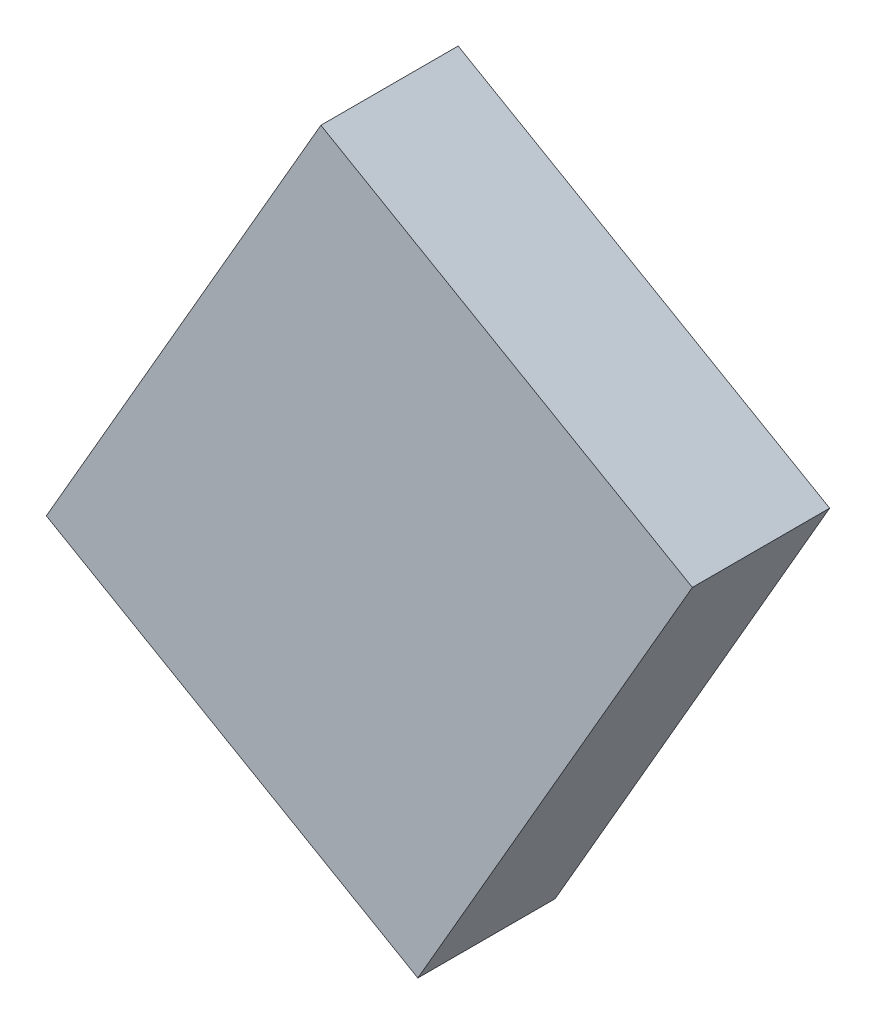
ISO-10303-21;
HEADER;
FILE_DESCRIPTION(('STEP AP214'),'2;1');
FILE_NAME('part.step','',(''),(''),'','','');
FILE_SCHEMA(('AUTOMOTIVE_DESIGN { 1 0 10303 214 1 1 1 1 }'));
ENDSEC;
DATA;
#1=APPLICATION_CONTEXT('core data for automotive mechanical design processes');
#2=APPLICATION_PROTOCOL_DEFINITION('international standard','automotive_design',2000,#1);
#3=PRODUCT_CONTEXT('',#1,'mechanical');
#4=PRODUCT('Part','Part','',(#3));
#5=PRODUCT_RELATED_PRODUCT_CATEGORY('part','',(#4));
#6=PRODUCT_DEFINITION_FORMATION('','',#4);
#7=PRODUCT_DEFINITION_CONTEXT('part definition',#1,'design');
#8=PRODUCT_DEFINITION('design','',#6,#7);
#9=PRODUCT_DEFINITION_SHAPE('','',#8);
#10=(LENGTH_UNIT() NAMED_UNIT(*) SI_UNIT(.MILLI.,.METRE.));
#11=(NAMED_UNIT(*) PLANE_ANGLE_UNIT() SI_UNIT($,.RADIAN.));
#12=(NAMED_UNIT(*) SI_UNIT($,.STERADIAN.) SOLID_ANGLE_UNIT());
#13=UNCERTAINTY_MEASURE_WITH_UNIT(LENGTH_MEASURE(1.E-05),#10,'distance_accuracy_value','');
#14=(GEOMETRIC_REPRESENTATION_CONTEXT(3) GLOBAL_UNCERTAINTY_ASSIGNED_CONTEXT((#13)) GLOBAL_UNIT_ASSIGNED_CONTEXT((#10,
#11,#12)) REPRESENTATION_CONTEXT('',''));
#15=CARTESIAN_POINT('',(0.,0.,0.));
#16=DIRECTION('',(0.,0.,1.));
#17=DIRECTION('',(1.,0.,0.));
#18=AXIS2_PLACEMENT_3D('',#15,#16,#17);
#19=CARTESIAN_POINT('',(0.28253436,-2.0106386,0.80000094));
#20=DIRECTION('',(0.,0.,-1.));
#21=DIRECTION('',(-1.,0.,0.));
#22=AXIS2_PLACEMENT_3D('',#19,#20,#21);
#23=PLANE('',#22);
#24=DIRECTION('',(0.86602559790979,-0.499999663764879,0.));
#25=VECTOR('',#24,1.);
#26=CARTESIAN_POINT('',(1.8825337,0.7606411,0.80000094));
#27=LINE('',#26,#25);
#28=CARTESIAN_POINT('',(1.88253369999973,0.760641100000156,0.80000094));
#29=VERTEX_POINT('',#28);
#30=CARTESIAN_POINT('',(-0.282531819999916,2.01064114000015,0.80000094));
#31=VERTEX_POINT('',#30);
#32=EDGE_CURVE('E55',#29,#31,#27,.F.);
#33=ORIENTED_EDGE('',*,*,#32,.T.);
#34=DIRECTION('',(0.500000060750926,0.866025368709872,0.));
#35=VECTOR('',#34,1.);
#36=CARTESIAN_POINT('',(-0.28253182,2.01064114,0.80000094));
#37=LINE('',#36,#35);
#38=CARTESIAN_POINT('',(-1.88253115999973,-0.760638560000156,0.80000094));
#39=VERTEX_POINT('',#38);
#40=EDGE_CURVE('E57',#31,#39,#37,.F.);
#41=ORIENTED_EDGE('',*,*,#40,.T.);
#42=DIRECTION('',(-0.86602559790979,0.499999663764879,0.));
#43=VECTOR('',#42,1.);
#44=CARTESIAN_POINT('',(-1.88253116,-0.76063856,0.80000094));
#45=LINE('',#44,#43);
#46=CARTESIAN_POINT('',(0.282534359999832,-2.01063860000029,0.80000094));
#47=VERTEX_POINT('',#46);
#48=EDGE_CURVE('E20',#39,#47,#45,.F.);
#49=ORIENTED_EDGE('',*,*,#48,.T.);
#50=DIRECTION('',(-0.500000060750926,-0.866025368709872,0.));
#51=VECTOR('',#50,1.);
#52=CARTESIAN_POINT('',(0.28253436,-2.0106386,0.80000094));
#53=LINE('',#52,#51);
#54=EDGE_CURVE('E80',#47,#29,#53,.F.);
#55=ORIENTED_EDGE('',*,*,#54,.T.);
#56=EDGE_LOOP('',(#33,#41,#49,#55));
#57=FACE_BOUND('',#56,.T.);
#58=ADVANCED_FACE('F17',(#57),#23,.F.);
#59=CARTESIAN_POINT('',(-1.88253116,-0.76063856,0.));
#60=DIRECTION('',(0.499999663764879,0.86602559790979,0.));
#61=DIRECTION('',(-0.86602559790979,0.499999663764879,0.));
#62=AXIS2_PLACEMENT_3D('',#59,#60,#61);
#63=PLANE('',#62);
#64=DIRECTION('',(0.,0.,1.));
#65=VECTOR('',#64,1.);
#66=CARTESIAN_POINT('',(0.28253436,-2.0106386,0.));
#67=LINE('',#66,#65);
#68=CARTESIAN_POINT('',(0.282534359999833,-2.01063860000029,0.));
#69=VERTEX_POINT('',#68);
#70=EDGE_CURVE('E68',#69,#47,#67,.T.);
#71=ORIENTED_EDGE('',*,*,#70,.T.);
#72=ORIENTED_EDGE('',*,*,#48,.F.);
#73=DIRECTION('',(0.,0.,1.));
#74=VECTOR('',#73,1.);
#75=CARTESIAN_POINT('',(-1.88253115999892,-0.760638560000622,0.));
#76=LINE('',#75,#74);
#77=CARTESIAN_POINT('',(-1.88253115999973,-0.760638560000156,0.));
#78=VERTEX_POINT('',#77);
#79=EDGE_CURVE('E63',#39,#78,#76,.F.);
#80=ORIENTED_EDGE('',*,*,#79,.T.);
#81=DIRECTION('',(-0.866025597909924,0.499999663764646,0.));
#82=VECTOR('',#81,1.);
#83=CARTESIAN_POINT('',(0.28253436,-2.0106386,0.));
#84=LINE('',#83,#82);
#85=EDGE_CURVE('E83',#69,#78,#84,.T.);
#86=ORIENTED_EDGE('',*,*,#85,.F.);
#87=EDGE_LOOP('',(#71,#72,#80,#86));
#88=FACE_BOUND('',#87,.T.);
#89=ADVANCED_FACE('F65',(#88),#63,.F.);
#90=CARTESIAN_POINT('',(-0.28253182,2.01064114,0.));
#91=DIRECTION('',(0.866025368709872,-0.500000060750926,0.));
#92=DIRECTION('',(0.500000060750926,0.866025368709872,0.));
#93=AXIS2_PLACEMENT_3D('',#90,#91,#92);
#94=PLANE('',#93);
#95=ORIENTED_EDGE('',*,*,#79,.F.);
#96=ORIENTED_EDGE('',*,*,#40,.F.);
#97=DIRECTION('',(0.,0.,1.));
#98=VECTOR('',#97,1.);
#99=CARTESIAN_POINT('',(-0.282531819999665,2.01064114000058,0.));
#100=LINE('',#99,#98);
#101=CARTESIAN_POINT('',(-0.282531819999916,2.01064114000015,0.));
#102=VERTEX_POINT('',#101);
#103=EDGE_CURVE('E75',#31,#102,#100,.F.);
#104=ORIENTED_EDGE('',*,*,#103,.T.);
#105=DIRECTION('',(0.500000060751263,0.866025368709678,0.));
#106=VECTOR('',#105,1.);
#107=CARTESIAN_POINT('',(-1.88253116,-0.76063856,0.));
#108=LINE('',#107,#106);
#109=EDGE_CURVE('E72',#78,#102,#108,.T.);
#110=ORIENTED_EDGE('',*,*,#109,.F.);
#111=EDGE_LOOP('',(#95,#96,#104,#110));
#112=FACE_BOUND('',#111,.T.);
#113=ADVANCED_FACE('F70',(#112),#94,.F.);
#114=CARTESIAN_POINT('',(1.8825337,0.7606411,0.));
#115=DIRECTION('',(-0.499999663764879,-0.86602559790979,0.));
#116=DIRECTION('',(0.86602559790979,-0.499999663764879,0.));
#117=AXIS2_PLACEMENT_3D('',#114,#115,#116);
#118=PLANE('',#117);
#119=ORIENTED_EDGE('',*,*,#103,.F.);
#120=ORIENTED_EDGE('',*,*,#32,.F.);
#121=DIRECTION('',(0.,0.,1.));
#122=VECTOR('',#121,1.);
#123=CARTESIAN_POINT('',(1.88253369999892,0.760641100000622,0.));
#124=LINE('',#123,#122);
#125=CARTESIAN_POINT('',(1.88253369999973,0.760641100000156,0.));
#126=VERTEX_POINT('',#125);
#127=EDGE_CURVE('E35',#29,#126,#124,.F.);
#128=ORIENTED_EDGE('',*,*,#127,.T.);
#129=DIRECTION('',(0.866025597909924,-0.499999663764646,0.));
#130=VECTOR('',#129,1.);
#131=CARTESIAN_POINT('',(-0.28253182,2.01064114,0.));
#132=LINE('',#131,#130);
#133=EDGE_CURVE('E26',#102,#126,#132,.T.);
#134=ORIENTED_EDGE('',*,*,#133,.F.);
#135=EDGE_LOOP('',(#119,#120,#128,#134));
#136=FACE_BOUND('',#135,.T.);
#137=ADVANCED_FACE('F89',(#136),#118,.F.);
#138=CARTESIAN_POINT('',(0.28253436,-2.0106386,0.));
#139=DIRECTION('',(-0.866025368709872,0.500000060750926,0.));
#140=DIRECTION('',(-0.500000060750926,-0.866025368709872,0.));
#141=AXIS2_PLACEMENT_3D('',#138,#139,#140);
#142=PLANE('',#141);
#143=ORIENTED_EDGE('',*,*,#127,.F.);
#144=ORIENTED_EDGE('',*,*,#54,.F.);
#145=ORIENTED_EDGE('',*,*,#70,.F.);
#146=DIRECTION('',(-0.500000060751263,-0.866025368709678,0.));
#147=VECTOR('',#146,1.);
#148=CARTESIAN_POINT('',(1.8825337,0.7606411,0.));
#149=LINE('',#148,#147);
#150=EDGE_CURVE('E11',#126,#69,#149,.T.);
#151=ORIENTED_EDGE('',*,*,#150,.F.);
#152=EDGE_LOOP('',(#143,#144,#145,#151));
#153=FACE_BOUND('',#152,.T.);
#154=ADVANCED_FACE('F91',(#153),#142,.F.);
#155=CARTESIAN_POINT('',(0.28253436,-2.0106386,0.));
#156=DIRECTION('',(0.,0.,-1.));
#157=DIRECTION('',(-1.,0.,0.));
#158=AXIS2_PLACEMENT_3D('',#155,#156,#157);
#159=PLANE('',#158);
#160=ORIENTED_EDGE('',*,*,#133,.T.);
#161=ORIENTED_EDGE('',*,*,#150,.T.);
#162=ORIENTED_EDGE('',*,*,#85,.T.);
#163=ORIENTED_EDGE('',*,*,#109,.T.);
#164=EDGE_LOOP('',(#160,#161,#162,#163));
#165=FACE_BOUND('',#164,.T.);
#166=ADVANCED_FACE('F88',(#165),#159,.T.);
#167=CLOSED_SHELL('',(#58,#89,#113,#137,#154,#166));
#168=MANIFOLD_SOLID_BREP('B1',#167);
#169=ADVANCED_BREP_SHAPE_REPRESENTATION('',(#18,#168),#14);
#170=SHAPE_DEFINITION_REPRESENTATION(#9,#169);
ENDSEC;
END-ISO-10303-21;
